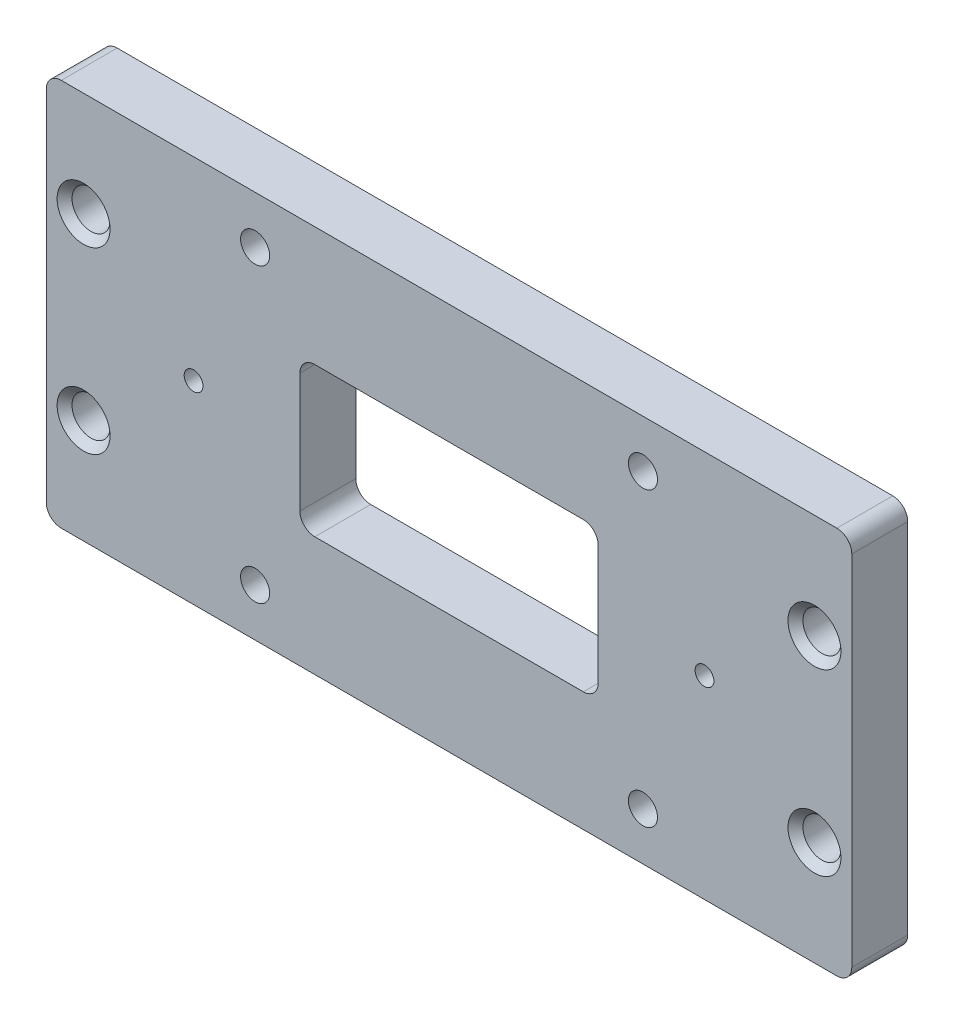
ISO-10303-21;
HEADER;
FILE_DESCRIPTION(('STEP AP214'),'2;1');
FILE_NAME('part.step','',(''),(''),'','','');
FILE_SCHEMA(('AUTOMOTIVE_DESIGN { 1 0 10303 214 1 1 1 1 }'));
ENDSEC;
DATA;
#1=APPLICATION_CONTEXT('core data for automotive mechanical design processes');
#2=APPLICATION_PROTOCOL_DEFINITION('international standard','automotive_design',2000,#1);
#3=PRODUCT_CONTEXT('',#1,'mechanical');
#4=PRODUCT('Part','Part','',(#3));
#5=PRODUCT_RELATED_PRODUCT_CATEGORY('part','',(#4));
#6=PRODUCT_DEFINITION_FORMATION('','',#4);
#7=PRODUCT_DEFINITION_CONTEXT('part definition',#1,'design');
#8=PRODUCT_DEFINITION('design','',#6,#7);
#9=PRODUCT_DEFINITION_SHAPE('','',#8);
#10=(LENGTH_UNIT() NAMED_UNIT(*) SI_UNIT(.MILLI.,.METRE.));
#11=(NAMED_UNIT(*) PLANE_ANGLE_UNIT() SI_UNIT($,.RADIAN.));
#12=(NAMED_UNIT(*) SI_UNIT($,.STERADIAN.) SOLID_ANGLE_UNIT());
#13=UNCERTAINTY_MEASURE_WITH_UNIT(LENGTH_MEASURE(1.E-05),#10,'distance_accuracy_value','');
#14=(GEOMETRIC_REPRESENTATION_CONTEXT(3) GLOBAL_UNCERTAINTY_ASSIGNED_CONTEXT((#13)) GLOBAL_UNIT_ASSIGNED_CONTEXT((#10,
#11,#12)) REPRESENTATION_CONTEXT('',''));
#15=CARTESIAN_POINT('',(0.,0.,0.));
#16=DIRECTION('',(0.,0.,1.));
#17=DIRECTION('',(1.,0.,0.));
#18=AXIS2_PLACEMENT_3D('',#15,#16,#17);
#19=CARTESIAN_POINT('',(68.58,-33.02,9.525));
#20=DIRECTION('',(-1.,0.,0.));
#21=DIRECTION('',(0.,0.,1.));
#22=AXIS2_PLACEMENT_3D('',#19,#20,#21);
#23=PLANE('',#22);
#24=DIRECTION('',(0.,1.,0.));
#25=VECTOR('',#24,1.);
#26=CARTESIAN_POINT('',(68.58,-33.02,9.525));
#27=LINE('',#26,#25);
#28=CARTESIAN_POINT('',(68.58,-30.48,9.525));
#29=VERTEX_POINT('',#28);
#30=CARTESIAN_POINT('',(68.58,30.48,9.525));
#31=VERTEX_POINT('',#30);
#32=EDGE_CURVE('E214',#29,#31,#27,.T.);
#33=ORIENTED_EDGE('',*,*,#32,.F.);
#34=DIRECTION('',(0.,0.,-1.));
#35=VECTOR('',#34,1.);
#36=CARTESIAN_POINT('',(68.58,-30.48,9.525));
#37=LINE('',#36,#35);
#38=CARTESIAN_POINT('',(68.58,-30.48,0.));
#39=VERTEX_POINT('',#38);
#40=EDGE_CURVE('E259',#29,#39,#37,.T.);
#41=ORIENTED_EDGE('',*,*,#40,.T.);
#42=DIRECTION('',(0.,1.,0.));
#43=VECTOR('',#42,1.);
#44=CARTESIAN_POINT('',(68.58,-33.02,0.));
#45=LINE('',#44,#43);
#46=CARTESIAN_POINT('',(68.58,30.48,0.));
#47=VERTEX_POINT('',#46);
#48=EDGE_CURVE('E517',#39,#47,#45,.T.);
#49=ORIENTED_EDGE('',*,*,#48,.T.);
#50=DIRECTION('',(0.,0.,-1.));
#51=VECTOR('',#50,1.);
#52=CARTESIAN_POINT('',(68.58,30.48,9.525));
#53=LINE('',#52,#51);
#54=EDGE_CURVE('E256',#47,#31,#53,.F.);
#55=ORIENTED_EDGE('',*,*,#54,.T.);
#56=EDGE_LOOP('',(#33,#41,#49,#55));
#57=FACE_BOUND('',#56,.T.);
#58=ADVANCED_FACE('F40',(#57),#23,.F.);
#59=CARTESIAN_POINT('',(-68.58,33.02,9.525));
#60=DIRECTION('',(0.,-1.,0.));
#61=DIRECTION('',(0.,0.,-1.));
#62=AXIS2_PLACEMENT_3D('',#59,#60,#61);
#63=PLANE('',#62);
#64=DIRECTION('',(-1.,0.,0.));
#65=VECTOR('',#64,1.);
#66=CARTESIAN_POINT('',(-68.58,33.02,0.));
#67=LINE('',#66,#65);
#68=CARTESIAN_POINT('',(66.04,33.02,0.));
#69=VERTEX_POINT('',#68);
#70=CARTESIAN_POINT('',(-66.04,33.02,0.));
#71=VERTEX_POINT('',#70);
#72=EDGE_CURVE('E224',#69,#71,#67,.T.);
#73=ORIENTED_EDGE('',*,*,#72,.T.);
#74=DIRECTION('',(0.,0.,-1.));
#75=VECTOR('',#74,1.);
#76=CARTESIAN_POINT('',(-66.04,33.02,9.525));
#77=LINE('',#76,#75);
#78=CARTESIAN_POINT('',(-66.04,33.02,9.525));
#79=VERTEX_POINT('',#78);
#80=EDGE_CURVE('E254',#71,#79,#77,.F.);
#81=ORIENTED_EDGE('',*,*,#80,.T.);
#82=DIRECTION('',(-1.,0.,0.));
#83=VECTOR('',#82,1.);
#84=CARTESIAN_POINT('',(-68.58,33.02,9.525));
#85=LINE('',#84,#83);
#86=CARTESIAN_POINT('',(66.04,33.02,9.525));
#87=VERTEX_POINT('',#86);
#88=EDGE_CURVE('E221',#87,#79,#85,.T.);
#89=ORIENTED_EDGE('',*,*,#88,.F.);
#90=DIRECTION('',(0.,0.,-1.));
#91=VECTOR('',#90,1.);
#92=CARTESIAN_POINT('',(66.04,33.02,9.525));
#93=LINE('',#92,#91);
#94=EDGE_CURVE('E250',#87,#69,#93,.T.);
#95=ORIENTED_EDGE('',*,*,#94,.T.);
#96=EDGE_LOOP('',(#73,#81,#89,#95));
#97=FACE_BOUND('',#96,.T.);
#98=ADVANCED_FACE('F399',(#97),#63,.F.);
#99=CARTESIAN_POINT('',(-68.58,-33.02,9.525));
#100=DIRECTION('',(1.,0.,0.));
#101=DIRECTION('',(0.,0.,-1.));
#102=AXIS2_PLACEMENT_3D('',#99,#100,#101);
#103=PLANE('',#102);
#104=DIRECTION('',(0.,-1.,0.));
#105=VECTOR('',#104,1.);
#106=CARTESIAN_POINT('',(-68.58,-33.02,0.));
#107=LINE('',#106,#105);
#108=CARTESIAN_POINT('',(-68.58,30.48,0.));
#109=VERTEX_POINT('',#108);
#110=CARTESIAN_POINT('',(-68.58,-30.48,0.));
#111=VERTEX_POINT('',#110);
#112=EDGE_CURVE('E215',#109,#111,#107,.T.);
#113=ORIENTED_EDGE('',*,*,#112,.T.);
#114=DIRECTION('',(0.,0.,-1.));
#115=VECTOR('',#114,1.);
#116=CARTESIAN_POINT('',(-68.58,-30.48,9.525));
#117=LINE('',#116,#115);
#118=CARTESIAN_POINT('',(-68.58,-30.48,9.525));
#119=VERTEX_POINT('',#118);
#120=EDGE_CURVE('E189',#111,#119,#117,.F.);
#121=ORIENTED_EDGE('',*,*,#120,.T.);
#122=DIRECTION('',(0.,-1.,0.));
#123=VECTOR('',#122,1.);
#124=CARTESIAN_POINT('',(-68.58,-33.02,9.525));
#125=LINE('',#124,#123);
#126=CARTESIAN_POINT('',(-68.58,30.48,9.525));
#127=VERTEX_POINT('',#126);
#128=EDGE_CURVE('E520',#127,#119,#125,.T.);
#129=ORIENTED_EDGE('',*,*,#128,.F.);
#130=DIRECTION('',(0.,0.,-1.));
#131=VECTOR('',#130,1.);
#132=CARTESIAN_POINT('',(-68.58,30.48,9.525));
#133=LINE('',#132,#131);
#134=EDGE_CURVE('E195',#127,#109,#133,.T.);
#135=ORIENTED_EDGE('',*,*,#134,.T.);
#136=EDGE_LOOP('',(#113,#121,#129,#135));
#137=FACE_BOUND('',#136,.T.);
#138=ADVANCED_FACE('F405',(#137),#103,.F.);
#139=CARTESIAN_POINT('',(-68.58,-33.02,9.525));
#140=DIRECTION('',(0.,1.,0.));
#141=DIRECTION('',(0.,0.,1.));
#142=AXIS2_PLACEMENT_3D('',#139,#140,#141);
#143=PLANE('',#142);
#144=DIRECTION('',(1.,0.,0.));
#145=VECTOR('',#144,1.);
#146=CARTESIAN_POINT('',(-68.58,-33.02,9.525));
#147=LINE('',#146,#145);
#148=CARTESIAN_POINT('',(-66.04,-33.02,9.525));
#149=VERTEX_POINT('',#148);
#150=CARTESIAN_POINT('',(66.04,-33.02,9.525));
#151=VERTEX_POINT('',#150);
#152=EDGE_CURVE('E205',#149,#151,#147,.T.);
#153=ORIENTED_EDGE('',*,*,#152,.F.);
#154=DIRECTION('',(0.,0.,-1.));
#155=VECTOR('',#154,1.);
#156=CARTESIAN_POINT('',(-66.04,-33.02,9.525));
#157=LINE('',#156,#155);
#158=CARTESIAN_POINT('',(-66.04,-33.02,0.));
#159=VERTEX_POINT('',#158);
#160=EDGE_CURVE('E188',#149,#159,#157,.T.);
#161=ORIENTED_EDGE('',*,*,#160,.T.);
#162=DIRECTION('',(1.,0.,0.));
#163=VECTOR('',#162,1.);
#164=CARTESIAN_POINT('',(-68.58,-33.02,0.));
#165=LINE('',#164,#163);
#166=CARTESIAN_POINT('',(66.04,-33.02,0.));
#167=VERTEX_POINT('',#166);
#168=EDGE_CURVE('E202',#159,#167,#165,.T.);
#169=ORIENTED_EDGE('',*,*,#168,.T.);
#170=DIRECTION('',(0.,0.,-1.));
#171=VECTOR('',#170,1.);
#172=CARTESIAN_POINT('',(66.04,-33.02,9.525));
#173=LINE('',#172,#171);
#174=EDGE_CURVE('E208',#167,#151,#173,.F.);
#175=ORIENTED_EDGE('',*,*,#174,.T.);
#176=EDGE_LOOP('',(#153,#161,#169,#175));
#177=FACE_BOUND('',#176,.T.);
#178=ADVANCED_FACE('F201',(#177),#143,.F.);
#179=CARTESIAN_POINT('',(0.,0.,9.525));
#180=DIRECTION('',(0.,0.,-1.));
#181=DIRECTION('',(-1.,0.,0.));
#182=AXIS2_PLACEMENT_3D('',#179,#180,#181);
#183=PLANE('',#182);
#184=CARTESIAN_POINT('',(62.23,-15.24,9.525));
#185=DIRECTION('',(0.,0.,-1.));
#186=DIRECTION('',(-1.,0.,0.));
#187=AXIS2_PLACEMENT_3D('',#184,#185,#186);
#188=CIRCLE('',#187,4.50849999999997);
#189=CARTESIAN_POINT('',(57.7215,-15.24,9.525));
#190=VERTEX_POINT('',#189);
#191=EDGE_CURVE('E11',#190,#190,#188,.T.);
#192=ORIENTED_EDGE('',*,*,#191,.T.);
#193=EDGE_LOOP('',(#192));
#194=FACE_BOUND('',#193,.T.);
#195=CARTESIAN_POINT('',(62.23,15.24,9.525));
#196=DIRECTION('',(0.,0.,-1.));
#197=DIRECTION('',(-1.,0.,0.));
#198=AXIS2_PLACEMENT_3D('',#195,#196,#197);
#199=CIRCLE('',#198,4.50849999999997);
#200=CARTESIAN_POINT('',(57.7215,15.24,9.525));
#201=VERTEX_POINT('',#200);
#202=EDGE_CURVE('E49',#201,#201,#199,.T.);
#203=ORIENTED_EDGE('',*,*,#202,.T.);
#204=EDGE_LOOP('',(#203));
#205=FACE_BOUND('',#204,.T.);
#206=CARTESIAN_POINT('',(-62.23,-15.24,9.525));
#207=DIRECTION('',(0.,0.,-1.));
#208=DIRECTION('',(-1.,0.,0.));
#209=AXIS2_PLACEMENT_3D('',#206,#207,#208);
#210=CIRCLE('',#209,4.50850000000001);
#211=CARTESIAN_POINT('',(-66.7385,-15.24,9.525));
#212=VERTEX_POINT('',#211);
#213=EDGE_CURVE('E362',#212,#212,#210,.T.);
#214=ORIENTED_EDGE('',*,*,#213,.T.);
#215=EDGE_LOOP('',(#214));
#216=FACE_BOUND('',#215,.T.);
#217=CARTESIAN_POINT('',(-62.23,15.24,9.525));
#218=DIRECTION('',(0.,0.,-1.));
#219=DIRECTION('',(-1.,0.,0.));
#220=AXIS2_PLACEMENT_3D('',#217,#218,#219);
#221=CIRCLE('',#220,4.5085);
#222=CARTESIAN_POINT('',(-66.7385,15.24,9.525));
#223=VERTEX_POINT('',#222);
#224=EDGE_CURVE('E358',#223,#223,#221,.T.);
#225=ORIENTED_EDGE('',*,*,#224,.T.);
#226=EDGE_LOOP('',(#225));
#227=FACE_BOUND('',#226,.T.);
#228=DIRECTION('',(-1.,0.,0.));
#229=VECTOR('',#228,1.);
#230=CARTESIAN_POINT('',(-25.4,12.7,9.525));
#231=LINE('',#230,#229);
#232=CARTESIAN_POINT('',(22.86,12.7,9.525));
#233=VERTEX_POINT('',#232);
#234=CARTESIAN_POINT('',(-22.86,12.7,9.525));
#235=VERTEX_POINT('',#234);
#236=EDGE_CURVE('E593',#233,#235,#231,.T.);
#237=ORIENTED_EDGE('',*,*,#236,.F.);
#238=CARTESIAN_POINT('',(22.86,10.16,9.525));
#239=DIRECTION('',(0.,0.,-1.));
#240=DIRECTION('',(-1.,0.,0.));
#241=AXIS2_PLACEMENT_3D('',#238,#239,#240);
#242=CIRCLE('',#241,2.54);
#243=CARTESIAN_POINT('',(25.4,10.16,9.525));
#244=VERTEX_POINT('',#243);
#245=EDGE_CURVE('E295',#233,#244,#242,.T.);
#246=ORIENTED_EDGE('',*,*,#245,.T.);
#247=DIRECTION('',(0.,1.,0.));
#248=VECTOR('',#247,1.);
#249=CARTESIAN_POINT('',(25.4,-12.7,9.525));
#250=LINE('',#249,#248);
#251=CARTESIAN_POINT('',(25.4,-10.16,9.525));
#252=VERTEX_POINT('',#251);
#253=EDGE_CURVE('E597',#252,#244,#250,.T.);
#254=ORIENTED_EDGE('',*,*,#253,.F.);
#255=CARTESIAN_POINT('',(22.86,-10.16,9.525));
#256=DIRECTION('',(0.,0.,-1.));
#257=DIRECTION('',(-1.,0.,0.));
#258=AXIS2_PLACEMENT_3D('',#255,#256,#257);
#259=CIRCLE('',#258,2.54);
#260=CARTESIAN_POINT('',(22.86,-12.7,9.525));
#261=VERTEX_POINT('',#260);
#262=EDGE_CURVE('E301',#252,#261,#259,.T.);
#263=ORIENTED_EDGE('',*,*,#262,.T.);
#264=DIRECTION('',(1.,0.,0.));
#265=VECTOR('',#264,1.);
#266=CARTESIAN_POINT('',(-25.4,-12.7,9.525));
#267=LINE('',#266,#265);
#268=CARTESIAN_POINT('',(-22.86,-12.7,9.525));
#269=VERTEX_POINT('',#268);
#270=EDGE_CURVE('E585',#269,#261,#267,.T.);
#271=ORIENTED_EDGE('',*,*,#270,.F.);
#272=CARTESIAN_POINT('',(-22.86,-10.16,9.525));
#273=DIRECTION('',(0.,0.,-1.));
#274=DIRECTION('',(-1.,0.,0.));
#275=AXIS2_PLACEMENT_3D('',#272,#273,#274);
#276=CIRCLE('',#275,2.54);
#277=CARTESIAN_POINT('',(-25.4,-10.16,9.525));
#278=VERTEX_POINT('',#277);
#279=EDGE_CURVE('E289',#269,#278,#276,.T.);
#280=ORIENTED_EDGE('',*,*,#279,.T.);
#281=DIRECTION('',(0.,-1.,0.));
#282=VECTOR('',#281,1.);
#283=CARTESIAN_POINT('',(-25.4,-12.7,9.525));
#284=LINE('',#283,#282);
#285=CARTESIAN_POINT('',(-25.4,10.16,9.525));
#286=VERTEX_POINT('',#285);
#287=EDGE_CURVE('E589',#286,#278,#284,.T.);
#288=ORIENTED_EDGE('',*,*,#287,.F.);
#289=CARTESIAN_POINT('',(-22.86,10.16,9.525));
#290=DIRECTION('',(0.,0.,-1.));
#291=DIRECTION('',(-1.,0.,0.));
#292=AXIS2_PLACEMENT_3D('',#289,#290,#291);
#293=CIRCLE('',#292,2.54);
#294=EDGE_CURVE('E306',#286,#235,#293,.T.);
#295=ORIENTED_EDGE('',*,*,#294,.T.);
#296=EDGE_LOOP('',(#237,#246,#254,#263,#271,#280,#288,#295));
#297=FACE_BOUND('',#296,.T.);
#298=CARTESIAN_POINT('',(43.5,0.,9.525));
#299=DIRECTION('',(0.,0.,1.));
#300=DIRECTION('',(-1.,0.,0.));
#301=AXIS2_PLACEMENT_3D('',#298,#299,#300);
#302=CIRCLE('',#301,1.60000000000001);
#303=CARTESIAN_POINT('',(41.9,0.,9.525));
#304=VERTEX_POINT('',#303);
#305=EDGE_CURVE('E571',#304,#304,#302,.T.);
#306=ORIENTED_EDGE('',*,*,#305,.F.);
#307=EDGE_LOOP('',(#306));
#308=FACE_BOUND('',#307,.T.);
#309=CARTESIAN_POINT('',(-43.5,0.,9.525));
#310=DIRECTION('',(0.,0.,1.));
#311=DIRECTION('',(1.,0.,0.));
#312=AXIS2_PLACEMENT_3D('',#309,#310,#311);
#313=CIRCLE('',#312,1.60000000000001);
#314=CARTESIAN_POINT('',(-41.9,0.,9.525));
#315=VERTEX_POINT('',#314);
#316=EDGE_CURVE('E548',#315,#315,#313,.T.);
#317=ORIENTED_EDGE('',*,*,#316,.F.);
#318=EDGE_LOOP('',(#317));
#319=FACE_BOUND('',#318,.T.);
#320=CARTESIAN_POINT('',(33.02,24.892,9.525));
#321=DIRECTION('',(0.,0.,1.));
#322=DIRECTION('',(-1.,0.,0.));
#323=AXIS2_PLACEMENT_3D('',#320,#321,#322);
#324=CIRCLE('',#323,2.4765);
#325=CARTESIAN_POINT('',(30.5435,24.892,9.525));
#326=VERTEX_POINT('',#325);
#327=EDGE_CURVE('E560',#326,#326,#324,.T.);
#328=ORIENTED_EDGE('',*,*,#327,.F.);
#329=EDGE_LOOP('',(#328));
#330=FACE_BOUND('',#329,.T.);
#331=CARTESIAN_POINT('',(33.02,-24.892,9.525));
#332=DIRECTION('',(0.,0.,1.));
#333=DIRECTION('',(1.,0.,0.));
#334=AXIS2_PLACEMENT_3D('',#331,#332,#333);
#335=CIRCLE('',#334,2.4765);
#336=CARTESIAN_POINT('',(35.4965,-24.892,9.525));
#337=VERTEX_POINT('',#336);
#338=EDGE_CURVE('E552',#337,#337,#335,.T.);
#339=ORIENTED_EDGE('',*,*,#338,.F.);
#340=EDGE_LOOP('',(#339));
#341=FACE_BOUND('',#340,.T.);
#342=CARTESIAN_POINT('',(-33.02,-24.892,9.525));
#343=DIRECTION('',(0.,0.,1.));
#344=DIRECTION('',(-1.,0.,0.));
#345=AXIS2_PLACEMENT_3D('',#342,#343,#344);
#346=CIRCLE('',#345,2.4765);
#347=CARTESIAN_POINT('',(-35.4965,-24.892,9.525));
#348=VERTEX_POINT('',#347);
#349=EDGE_CURVE('E543',#348,#348,#346,.T.);
#350=ORIENTED_EDGE('',*,*,#349,.F.);
#351=EDGE_LOOP('',(#350));
#352=FACE_BOUND('',#351,.T.);
#353=CARTESIAN_POINT('',(-33.02,24.892,9.525));
#354=DIRECTION('',(0.,0.,1.));
#355=DIRECTION('',(1.,0.,0.));
#356=AXIS2_PLACEMENT_3D('',#353,#354,#355);
#357=CIRCLE('',#356,2.4765);
#358=CARTESIAN_POINT('',(-30.5435,24.892,9.525));
#359=VERTEX_POINT('',#358);
#360=EDGE_CURVE('E533',#359,#359,#357,.T.);
#361=ORIENTED_EDGE('',*,*,#360,.F.);
#362=EDGE_LOOP('',(#361));
#363=FACE_BOUND('',#362,.T.);
#364=ORIENTED_EDGE('',*,*,#128,.T.);
#365=CARTESIAN_POINT('',(-66.04,-30.48,9.525));
#366=DIRECTION('',(0.,0.,-1.));
#367=DIRECTION('',(-1.,0.,0.));
#368=AXIS2_PLACEMENT_3D('',#365,#366,#367);
#369=CIRCLE('',#368,2.54);
#370=EDGE_CURVE('E247',#119,#149,#369,.F.);
#371=ORIENTED_EDGE('',*,*,#370,.T.);
#372=ORIENTED_EDGE('',*,*,#152,.T.);
#373=CARTESIAN_POINT('',(66.04,-30.48,9.525));
#374=DIRECTION('',(0.,0.,-1.));
#375=DIRECTION('',(-1.,0.,0.));
#376=AXIS2_PLACEMENT_3D('',#373,#374,#375);
#377=CIRCLE('',#376,2.54);
#378=EDGE_CURVE('E242',#151,#29,#377,.F.);
#379=ORIENTED_EDGE('',*,*,#378,.T.);
#380=ORIENTED_EDGE('',*,*,#32,.T.);
#381=CARTESIAN_POINT('',(66.04,30.48,9.525));
#382=DIRECTION('',(0.,0.,-1.));
#383=DIRECTION('',(-1.,0.,0.));
#384=AXIS2_PLACEMENT_3D('',#381,#382,#383);
#385=CIRCLE('',#384,2.54);
#386=EDGE_CURVE('E239',#31,#87,#385,.F.);
#387=ORIENTED_EDGE('',*,*,#386,.T.);
#388=ORIENTED_EDGE('',*,*,#88,.T.);
#389=CARTESIAN_POINT('',(-66.04,30.48,9.525));
#390=DIRECTION('',(0.,0.,-1.));
#391=DIRECTION('',(-1.,0.,0.));
#392=AXIS2_PLACEMENT_3D('',#389,#390,#391);
#393=CIRCLE('',#392,2.54);
#394=EDGE_CURVE('E245',#79,#127,#393,.F.);
#395=ORIENTED_EDGE('',*,*,#394,.T.);
#396=EDGE_LOOP('',(#364,#371,#372,#379,#380,#387,#388,#395));
#397=FACE_BOUND('',#396,.T.);
#398=ADVANCED_FACE('F371',(#194,#205,#216,#227,#297,#308,#319,#330,#341,#352,#363,#397),#183,.F.);
#399=CARTESIAN_POINT('',(0.,0.,0.));
#400=DIRECTION('',(0.,0.,-1.));
#401=DIRECTION('',(-1.,0.,0.));
#402=AXIS2_PLACEMENT_3D('',#399,#400,#401);
#403=PLANE('',#402);
#404=CARTESIAN_POINT('',(-62.23,-15.24,0.));
#405=DIRECTION('',(0.,0.,-1.));
#406=DIRECTION('',(-1.,0.,0.));
#407=AXIS2_PLACEMENT_3D('',#404,#405,#406);
#408=CIRCLE('',#407,4.50849999999997);
#409=CARTESIAN_POINT('',(-66.7385,-15.24,0.));
#410=VERTEX_POINT('',#409);
#411=EDGE_CURVE('E323',#410,#410,#408,.F.);
#412=ORIENTED_EDGE('',*,*,#411,.T.);
#413=EDGE_LOOP('',(#412));
#414=FACE_BOUND('',#413,.T.);
#415=CARTESIAN_POINT('',(-62.23,15.24,0.));
#416=DIRECTION('',(0.,0.,-1.));
#417=DIRECTION('',(-1.,0.,0.));
#418=AXIS2_PLACEMENT_3D('',#415,#416,#417);
#419=CIRCLE('',#418,4.50849999999998);
#420=CARTESIAN_POINT('',(-66.7385,15.24,0.));
#421=VERTEX_POINT('',#420);
#422=EDGE_CURVE('E320',#421,#421,#419,.F.);
#423=ORIENTED_EDGE('',*,*,#422,.T.);
#424=EDGE_LOOP('',(#423));
#425=FACE_BOUND('',#424,.T.);
#426=CARTESIAN_POINT('',(62.23,-15.24,0.));
#427=DIRECTION('',(0.,0.,-1.));
#428=DIRECTION('',(-1.,0.,0.));
#429=AXIS2_PLACEMENT_3D('',#426,#427,#428);
#430=CIRCLE('',#429,4.50849999999997);
#431=CARTESIAN_POINT('',(57.7215,-15.24,0.));
#432=VERTEX_POINT('',#431);
#433=EDGE_CURVE('E316',#432,#432,#430,.F.);
#434=ORIENTED_EDGE('',*,*,#433,.T.);
#435=EDGE_LOOP('',(#434));
#436=FACE_BOUND('',#435,.T.);
#437=CARTESIAN_POINT('',(62.23,15.24,0.));
#438=DIRECTION('',(0.,0.,-1.));
#439=DIRECTION('',(-1.,0.,0.));
#440=AXIS2_PLACEMENT_3D('',#437,#438,#439);
#441=CIRCLE('',#440,4.5085);
#442=CARTESIAN_POINT('',(57.7215,15.24,0.));
#443=VERTEX_POINT('',#442);
#444=EDGE_CURVE('E312',#443,#443,#441,.F.);
#445=ORIENTED_EDGE('',*,*,#444,.T.);
#446=EDGE_LOOP('',(#445));
#447=FACE_BOUND('',#446,.T.);
#448=DIRECTION('',(1.,0.,0.));
#449=VECTOR('',#448,1.);
#450=CARTESIAN_POINT('',(-25.4,-12.7,0.));
#451=LINE('',#450,#449);
#452=CARTESIAN_POINT('',(-22.86,-12.7,0.));
#453=VERTEX_POINT('',#452);
#454=CARTESIAN_POINT('',(22.86,-12.7,0.));
#455=VERTEX_POINT('',#454);
#456=EDGE_CURVE('E602',#453,#455,#451,.T.);
#457=ORIENTED_EDGE('',*,*,#456,.T.);
#458=CARTESIAN_POINT('',(22.86,-10.16,0.));
#459=DIRECTION('',(0.,0.,-1.));
#460=DIRECTION('',(-1.,0.,0.));
#461=AXIS2_PLACEMENT_3D('',#458,#459,#460);
#462=CIRCLE('',#461,2.54);
#463=CARTESIAN_POINT('',(25.4,-10.16,0.));
#464=VERTEX_POINT('',#463);
#465=EDGE_CURVE('E68',#455,#464,#462,.F.);
#466=ORIENTED_EDGE('',*,*,#465,.T.);
#467=DIRECTION('',(0.,1.,0.));
#468=VECTOR('',#467,1.);
#469=CARTESIAN_POINT('',(25.4,-12.7,0.));
#470=LINE('',#469,#468);
#471=CARTESIAN_POINT('',(25.4,10.16,0.));
#472=VERTEX_POINT('',#471);
#473=EDGE_CURVE('E599',#464,#472,#470,.T.);
#474=ORIENTED_EDGE('',*,*,#473,.T.);
#475=CARTESIAN_POINT('',(22.86,10.16,0.));
#476=DIRECTION('',(0.,0.,-1.));
#477=DIRECTION('',(-1.,0.,0.));
#478=AXIS2_PLACEMENT_3D('',#475,#476,#477);
#479=CIRCLE('',#478,2.54);
#480=CARTESIAN_POINT('',(22.86,12.7,0.));
#481=VERTEX_POINT('',#480);
#482=EDGE_CURVE('E298',#472,#481,#479,.F.);
#483=ORIENTED_EDGE('',*,*,#482,.T.);
#484=DIRECTION('',(-1.,0.,0.));
#485=VECTOR('',#484,1.);
#486=CARTESIAN_POINT('',(-25.4,12.7,0.));
#487=LINE('',#486,#485);
#488=CARTESIAN_POINT('',(-22.86,12.7,0.));
#489=VERTEX_POINT('',#488);
#490=EDGE_CURVE('E579',#481,#489,#487,.T.);
#491=ORIENTED_EDGE('',*,*,#490,.T.);
#492=CARTESIAN_POINT('',(-22.86,10.16,0.));
#493=DIRECTION('',(0.,0.,-1.));
#494=DIRECTION('',(-1.,0.,0.));
#495=AXIS2_PLACEMENT_3D('',#492,#493,#494);
#496=CIRCLE('',#495,2.54);
#497=CARTESIAN_POINT('',(-25.4,10.16,0.));
#498=VERTEX_POINT('',#497);
#499=EDGE_CURVE('E309',#489,#498,#496,.F.);
#500=ORIENTED_EDGE('',*,*,#499,.T.);
#501=DIRECTION('',(0.,-1.,0.));
#502=VECTOR('',#501,1.);
#503=CARTESIAN_POINT('',(-25.4,-12.7,0.));
#504=LINE('',#503,#502);
#505=CARTESIAN_POINT('',(-25.4,-10.16,0.));
#506=VERTEX_POINT('',#505);
#507=EDGE_CURVE('E605',#498,#506,#504,.T.);
#508=ORIENTED_EDGE('',*,*,#507,.T.);
#509=CARTESIAN_POINT('',(-22.86,-10.16,0.));
#510=DIRECTION('',(0.,0.,-1.));
#511=DIRECTION('',(-1.,0.,0.));
#512=AXIS2_PLACEMENT_3D('',#509,#510,#511);
#513=CIRCLE('',#512,2.54);
#514=EDGE_CURVE('E292',#506,#453,#513,.F.);
#515=ORIENTED_EDGE('',*,*,#514,.T.);
#516=EDGE_LOOP('',(#457,#466,#474,#483,#491,#500,#508,#515));
#517=FACE_BOUND('',#516,.T.);
#518=CARTESIAN_POINT('',(43.5,0.,0.));
#519=DIRECTION('',(0.,0.,-1.));
#520=DIRECTION('',(-1.,0.,0.));
#521=AXIS2_PLACEMENT_3D('',#518,#519,#520);
#522=CIRCLE('',#521,1.60000000000001);
#523=CARTESIAN_POINT('',(41.9,0.,0.));
#524=VERTEX_POINT('',#523);
#525=EDGE_CURVE('E575',#524,#524,#522,.F.);
#526=ORIENTED_EDGE('',*,*,#525,.T.);
#527=EDGE_LOOP('',(#526));
#528=FACE_BOUND('',#527,.T.);
#529=CARTESIAN_POINT('',(-43.5,0.,0.));
#530=DIRECTION('',(0.,0.,-1.));
#531=DIRECTION('',(-1.,0.,0.));
#532=AXIS2_PLACEMENT_3D('',#529,#530,#531);
#533=CIRCLE('',#532,1.60000000000001);
#534=CARTESIAN_POINT('',(-45.1,0.,0.));
#535=VERTEX_POINT('',#534);
#536=EDGE_CURVE('E567',#535,#535,#533,.F.);
#537=ORIENTED_EDGE('',*,*,#536,.T.);
#538=EDGE_LOOP('',(#537));
#539=FACE_BOUND('',#538,.T.);
#540=CARTESIAN_POINT('',(33.02,24.892,0.));
#541=DIRECTION('',(0.,0.,1.));
#542=DIRECTION('',(-1.,0.,0.));
#543=AXIS2_PLACEMENT_3D('',#540,#541,#542);
#544=CIRCLE('',#543,2.4765);
#545=CARTESIAN_POINT('',(30.5435,24.892,0.));
#546=VERTEX_POINT('',#545);
#547=EDGE_CURVE('E540',#546,#546,#544,.T.);
#548=ORIENTED_EDGE('',*,*,#547,.T.);
#549=EDGE_LOOP('',(#548));
#550=FACE_BOUND('',#549,.T.);
#551=CARTESIAN_POINT('',(33.02,-24.892,0.));
#552=DIRECTION('',(0.,0.,1.));
#553=DIRECTION('',(1.,0.,0.));
#554=AXIS2_PLACEMENT_3D('',#551,#552,#553);
#555=CIRCLE('',#554,2.4765);
#556=CARTESIAN_POINT('',(35.4965,-24.892,0.));
#557=VERTEX_POINT('',#556);
#558=EDGE_CURVE('E556',#557,#557,#555,.T.);
#559=ORIENTED_EDGE('',*,*,#558,.T.);
#560=EDGE_LOOP('',(#559));
#561=FACE_BOUND('',#560,.T.);
#562=CARTESIAN_POINT('',(-33.02,-24.892,0.));
#563=DIRECTION('',(0.,0.,1.));
#564=DIRECTION('',(-1.,0.,0.));
#565=AXIS2_PLACEMENT_3D('',#562,#563,#564);
#566=CIRCLE('',#565,2.4765);
#567=CARTESIAN_POINT('',(-35.4965,-24.892,0.));
#568=VERTEX_POINT('',#567);
#569=EDGE_CURVE('E547',#568,#568,#566,.T.);
#570=ORIENTED_EDGE('',*,*,#569,.T.);
#571=EDGE_LOOP('',(#570));
#572=FACE_BOUND('',#571,.T.);
#573=CARTESIAN_POINT('',(-33.02,24.892,0.));
#574=DIRECTION('',(0.,0.,1.));
#575=DIRECTION('',(1.,0.,0.));
#576=AXIS2_PLACEMENT_3D('',#573,#574,#575);
#577=CIRCLE('',#576,2.4765);
#578=CARTESIAN_POINT('',(-30.5435,24.892,0.));
#579=VERTEX_POINT('',#578);
#580=EDGE_CURVE('E529',#579,#579,#577,.T.);
#581=ORIENTED_EDGE('',*,*,#580,.T.);
#582=EDGE_LOOP('',(#581));
#583=FACE_BOUND('',#582,.T.);
#584=ORIENTED_EDGE('',*,*,#168,.F.);
#585=CARTESIAN_POINT('',(-66.04,-30.48,0.));
#586=DIRECTION('',(0.,0.,-1.));
#587=DIRECTION('',(-1.,0.,0.));
#588=AXIS2_PLACEMENT_3D('',#585,#586,#587);
#589=CIRCLE('',#588,2.54);
#590=EDGE_CURVE('E184',#159,#111,#589,.T.);
#591=ORIENTED_EDGE('',*,*,#590,.T.);
#592=ORIENTED_EDGE('',*,*,#112,.F.);
#593=CARTESIAN_POINT('',(-66.04,30.48,0.));
#594=DIRECTION('',(0.,0.,-1.));
#595=DIRECTION('',(-1.,0.,0.));
#596=AXIS2_PLACEMENT_3D('',#593,#594,#595);
#597=CIRCLE('',#596,2.54);
#598=EDGE_CURVE('E196',#109,#71,#597,.T.);
#599=ORIENTED_EDGE('',*,*,#598,.T.);
#600=ORIENTED_EDGE('',*,*,#72,.F.);
#601=CARTESIAN_POINT('',(66.04,30.48,0.));
#602=DIRECTION('',(0.,0.,-1.));
#603=DIRECTION('',(-1.,0.,0.));
#604=AXIS2_PLACEMENT_3D('',#601,#602,#603);
#605=CIRCLE('',#604,2.54);
#606=EDGE_CURVE('E207',#69,#47,#605,.T.);
#607=ORIENTED_EDGE('',*,*,#606,.T.);
#608=ORIENTED_EDGE('',*,*,#48,.F.);
#609=CARTESIAN_POINT('',(66.04,-30.48,0.));
#610=DIRECTION('',(0.,0.,-1.));
#611=DIRECTION('',(-1.,0.,0.));
#612=AXIS2_PLACEMENT_3D('',#609,#610,#611);
#613=CIRCLE('',#612,2.54);
#614=EDGE_CURVE('E212',#39,#167,#613,.T.);
#615=ORIENTED_EDGE('',*,*,#614,.T.);
#616=EDGE_LOOP('',(#584,#591,#592,#599,#600,#607,#608,#615));
#617=FACE_BOUND('',#616,.T.);
#618=ADVANCED_FACE('F210',(#414,#425,#436,#447,#517,#528,#539,#550,#561,#572,#583,#617),#403,.T.);
#619=CARTESIAN_POINT('',(-33.02,24.892,0.));
#620=DIRECTION('',(0.,0.,1.));
#621=DIRECTION('',(1.,0.,0.));
#622=AXIS2_PLACEMENT_3D('',#619,#620,#621);
#623=CYLINDRICAL_SURFACE('',#622,2.4765);
#624=ORIENTED_EDGE('',*,*,#580,.F.);
#625=EDGE_LOOP('',(#624));
#626=FACE_BOUND('',#625,.T.);
#627=ORIENTED_EDGE('',*,*,#360,.T.);
#628=EDGE_LOOP('',(#627));
#629=FACE_BOUND('',#628,.T.);
#630=ADVANCED_FACE('F491',(#626,#629),#623,.F.);
#631=CARTESIAN_POINT('',(-33.02,-24.892,0.));
#632=DIRECTION('',(0.,0.,1.));
#633=DIRECTION('',(1.,0.,0.));
#634=AXIS2_PLACEMENT_3D('',#631,#632,#633);
#635=CYLINDRICAL_SURFACE('',#634,2.4765);
#636=ORIENTED_EDGE('',*,*,#569,.F.);
#637=EDGE_LOOP('',(#636));
#638=FACE_BOUND('',#637,.T.);
#639=ORIENTED_EDGE('',*,*,#349,.T.);
#640=EDGE_LOOP('',(#639));
#641=FACE_BOUND('',#640,.T.);
#642=ADVANCED_FACE('F487',(#638,#641),#635,.F.);
#643=CARTESIAN_POINT('',(33.02,-24.892,0.));
#644=DIRECTION('',(0.,0.,1.));
#645=DIRECTION('',(1.,0.,0.));
#646=AXIS2_PLACEMENT_3D('',#643,#644,#645);
#647=CYLINDRICAL_SURFACE('',#646,2.4765);
#648=ORIENTED_EDGE('',*,*,#558,.F.);
#649=EDGE_LOOP('',(#648));
#650=FACE_BOUND('',#649,.T.);
#651=ORIENTED_EDGE('',*,*,#338,.T.);
#652=EDGE_LOOP('',(#651));
#653=FACE_BOUND('',#652,.T.);
#654=ADVANCED_FACE('F483',(#650,#653),#647,.F.);
#655=CARTESIAN_POINT('',(33.02,24.892,0.));
#656=DIRECTION('',(0.,0.,1.));
#657=DIRECTION('',(1.,0.,0.));
#658=AXIS2_PLACEMENT_3D('',#655,#656,#657);
#659=CYLINDRICAL_SURFACE('',#658,2.4765);
#660=ORIENTED_EDGE('',*,*,#547,.F.);
#661=EDGE_LOOP('',(#660));
#662=FACE_BOUND('',#661,.T.);
#663=ORIENTED_EDGE('',*,*,#327,.T.);
#664=EDGE_LOOP('',(#663));
#665=FACE_BOUND('',#664,.T.);
#666=ADVANCED_FACE('F477',(#662,#665),#659,.F.);
#667=CARTESIAN_POINT('',(-62.23,15.24,-0.000999999999999265));
#668=DIRECTION('',(0.,0.,1.));
#669=DIRECTION('',(1.,0.,0.));
#670=AXIS2_PLACEMENT_3D('',#667,#668,#669);
#671=CYLINDRICAL_SURFACE('',#670,3.2385);
#672=CARTESIAN_POINT('',(-62.23,15.24,1.27));
#673=DIRECTION('',(0.,0.,-1.));
#674=DIRECTION('',(-1.,0.,0.));
#675=AXIS2_PLACEMENT_3D('',#672,#673,#674);
#676=CIRCLE('',#675,3.2385);
#677=CARTESIAN_POINT('',(-65.4685,15.24,1.27));
#678=VERTEX_POINT('',#677);
#679=EDGE_CURVE('E339',#678,#678,#676,.T.);
#680=ORIENTED_EDGE('',*,*,#679,.T.);
#681=EDGE_LOOP('',(#680));
#682=FACE_BOUND('',#681,.T.);
#683=CARTESIAN_POINT('',(-62.23,15.24,8.25500000000001));
#684=DIRECTION('',(0.,0.,-1.));
#685=DIRECTION('',(-1.,0.,0.));
#686=AXIS2_PLACEMENT_3D('',#683,#684,#685);
#687=CIRCLE('',#686,3.2385);
#688=CARTESIAN_POINT('',(-65.4685,15.24,8.25500000000001));
#689=VERTEX_POINT('',#688);
#690=EDGE_CURVE('E335',#689,#689,#687,.F.);
#691=ORIENTED_EDGE('',*,*,#690,.T.);
#692=EDGE_LOOP('',(#691));
#693=FACE_BOUND('',#692,.T.);
#694=ADVANCED_FACE('F471',(#682,#693),#671,.F.);
#695=CARTESIAN_POINT('',(-62.23,-15.24,-0.000999999999999265));
#696=DIRECTION('',(0.,0.,1.));
#697=DIRECTION('',(1.,0.,0.));
#698=AXIS2_PLACEMENT_3D('',#695,#696,#697);
#699=CYLINDRICAL_SURFACE('',#698,3.2385);
#700=CARTESIAN_POINT('',(-62.23,-15.24,1.26999999999999));
#701=DIRECTION('',(0.,0.,-1.));
#702=DIRECTION('',(-1.,0.,0.));
#703=AXIS2_PLACEMENT_3D('',#700,#701,#702);
#704=CIRCLE('',#703,3.2385);
#705=CARTESIAN_POINT('',(-65.4685,-15.24,1.26999999999999));
#706=VERTEX_POINT('',#705);
#707=EDGE_CURVE('E331',#706,#706,#704,.T.);
#708=ORIENTED_EDGE('',*,*,#707,.T.);
#709=EDGE_LOOP('',(#708));
#710=FACE_BOUND('',#709,.T.);
#711=CARTESIAN_POINT('',(-62.23,-15.24,8.25499999999998));
#712=DIRECTION('',(0.,0.,-1.));
#713=DIRECTION('',(-1.,0.,0.));
#714=AXIS2_PLACEMENT_3D('',#711,#712,#713);
#715=CIRCLE('',#714,3.2385);
#716=CARTESIAN_POINT('',(-65.4685,-15.24,8.25499999999998));
#717=VERTEX_POINT('',#716);
#718=EDGE_CURVE('E327',#717,#717,#715,.F.);
#719=ORIENTED_EDGE('',*,*,#718,.T.);
#720=EDGE_LOOP('',(#719));
#721=FACE_BOUND('',#720,.T.);
#722=ADVANCED_FACE('F395',(#710,#721),#699,.F.);
#723=CARTESIAN_POINT('',(62.23,-15.24,-0.000999999999999265));
#724=DIRECTION('',(0.,0.,1.));
#725=DIRECTION('',(1.,0.,0.));
#726=AXIS2_PLACEMENT_3D('',#723,#724,#725);
#727=CYLINDRICAL_SURFACE('',#726,3.23849999999999);
#728=CARTESIAN_POINT('',(62.23,-15.24,1.26999999999996));
#729=DIRECTION('',(0.,0.,-1.));
#730=DIRECTION('',(-1.,0.,0.));
#731=AXIS2_PLACEMENT_3D('',#728,#729,#730);
#732=CIRCLE('',#731,3.23849999999999);
#733=CARTESIAN_POINT('',(58.9915,-15.24,1.26999999999996));
#734=VERTEX_POINT('',#733);
#735=EDGE_CURVE('E346',#734,#734,#732,.T.);
#736=ORIENTED_EDGE('',*,*,#735,.T.);
#737=EDGE_LOOP('',(#736));
#738=FACE_BOUND('',#737,.T.);
#739=CARTESIAN_POINT('',(62.23,-15.24,8.25500000000002));
#740=DIRECTION('',(0.,0.,-1.));
#741=DIRECTION('',(-1.,0.,0.));
#742=AXIS2_PLACEMENT_3D('',#739,#740,#741);
#743=CIRCLE('',#742,3.23849999999999);
#744=CARTESIAN_POINT('',(58.9915,-15.24,8.25500000000002));
#745=VERTEX_POINT('',#744);
#746=EDGE_CURVE('E342',#745,#745,#743,.F.);
#747=ORIENTED_EDGE('',*,*,#746,.T.);
#748=EDGE_LOOP('',(#747));
#749=FACE_BOUND('',#748,.T.);
#750=ADVANCED_FACE('F385',(#738,#749),#727,.F.);
#751=CARTESIAN_POINT('',(62.23,15.24,-0.000999999999999265));
#752=DIRECTION('',(0.,0.,1.));
#753=DIRECTION('',(1.,0.,0.));
#754=AXIS2_PLACEMENT_3D('',#751,#752,#753);
#755=CYLINDRICAL_SURFACE('',#754,3.23850000000001);
#756=CARTESIAN_POINT('',(62.23,15.24,1.26999999999998));
#757=DIRECTION('',(0.,0.,-1.));
#758=DIRECTION('',(-1.,0.,0.));
#759=AXIS2_PLACEMENT_3D('',#756,#757,#758);
#760=CIRCLE('',#759,3.23850000000001);
#761=CARTESIAN_POINT('',(58.9915,15.24,1.26999999999998));
#762=VERTEX_POINT('',#761);
#763=EDGE_CURVE('E354',#762,#762,#760,.T.);
#764=ORIENTED_EDGE('',*,*,#763,.T.);
#765=EDGE_LOOP('',(#764));
#766=FACE_BOUND('',#765,.T.);
#767=CARTESIAN_POINT('',(62.23,15.24,8.25500000000003));
#768=DIRECTION('',(0.,0.,-1.));
#769=DIRECTION('',(-1.,0.,0.));
#770=AXIS2_PLACEMENT_3D('',#767,#768,#769);
#771=CIRCLE('',#770,3.23850000000001);
#772=CARTESIAN_POINT('',(58.9915,15.24,8.25500000000003));
#773=VERTEX_POINT('',#772);
#774=EDGE_CURVE('E350',#773,#773,#771,.F.);
#775=ORIENTED_EDGE('',*,*,#774,.T.);
#776=EDGE_LOOP('',(#775));
#777=FACE_BOUND('',#776,.T.);
#778=ADVANCED_FACE('F382',(#766,#777),#755,.F.);
#779=CARTESIAN_POINT('',(-43.5,0.,-0.000999999999999265));
#780=DIRECTION('',(0.,0.,1.));
#781=DIRECTION('',(1.,0.,0.));
#782=AXIS2_PLACEMENT_3D('',#779,#780,#781);
#783=CYLINDRICAL_SURFACE('',#782,1.60000000000001);
#784=ORIENTED_EDGE('',*,*,#536,.F.);
#785=EDGE_LOOP('',(#784));
#786=FACE_BOUND('',#785,.T.);
#787=ORIENTED_EDGE('',*,*,#316,.T.);
#788=EDGE_LOOP('',(#787));
#789=FACE_BOUND('',#788,.T.);
#790=ADVANCED_FACE('F384',(#786,#789),#783,.F.);
#791=CARTESIAN_POINT('',(43.5,0.,-0.000999999999999265));
#792=DIRECTION('',(0.,0.,1.));
#793=DIRECTION('',(1.,0.,0.));
#794=AXIS2_PLACEMENT_3D('',#791,#792,#793);
#795=CYLINDRICAL_SURFACE('',#794,1.60000000000001);
#796=ORIENTED_EDGE('',*,*,#525,.F.);
#797=EDGE_LOOP('',(#796));
#798=FACE_BOUND('',#797,.T.);
#799=ORIENTED_EDGE('',*,*,#305,.T.);
#800=EDGE_LOOP('',(#799));
#801=FACE_BOUND('',#800,.T.);
#802=ADVANCED_FACE('F392',(#798,#801),#795,.F.);
#803=CARTESIAN_POINT('',(25.4,-12.7,-0.000999999999999265));
#804=DIRECTION('',(1.,0.,0.));
#805=DIRECTION('',(0.,0.,-1.));
#806=AXIS2_PLACEMENT_3D('',#803,#804,#805);
#807=PLANE('',#806);
#808=ORIENTED_EDGE('',*,*,#253,.T.);
#809=DIRECTION('',(0.,0.,1.));
#810=VECTOR('',#809,1.);
#811=CARTESIAN_POINT('',(25.4,10.16,0.));
#812=LINE('',#811,#810);
#813=EDGE_CURVE('E59',#244,#472,#812,.F.);
#814=ORIENTED_EDGE('',*,*,#813,.T.);
#815=ORIENTED_EDGE('',*,*,#473,.F.);
#816=DIRECTION('',(0.,0.,1.));
#817=VECTOR('',#816,1.);
#818=CARTESIAN_POINT('',(25.4,-10.16,9.525));
#819=LINE('',#818,#817);
#820=EDGE_CURVE('E283',#464,#252,#819,.T.);
#821=ORIENTED_EDGE('',*,*,#820,.T.);
#822=EDGE_LOOP('',(#808,#814,#815,#821));
#823=FACE_BOUND('',#822,.T.);
#824=ADVANCED_FACE('F626',(#823),#807,.F.);
#825=CARTESIAN_POINT('',(-25.4,-12.7,-0.000999999999999265));
#826=DIRECTION('',(0.,-1.,0.));
#827=DIRECTION('',(0.,0.,-1.));
#828=AXIS2_PLACEMENT_3D('',#825,#826,#827);
#829=PLANE('',#828);
#830=ORIENTED_EDGE('',*,*,#456,.F.);
#831=DIRECTION('',(0.,0.,1.));
#832=VECTOR('',#831,1.);
#833=CARTESIAN_POINT('',(-22.86,-12.7,9.525));
#834=LINE('',#833,#832);
#835=EDGE_CURVE('E266',#453,#269,#834,.T.);
#836=ORIENTED_EDGE('',*,*,#835,.T.);
#837=ORIENTED_EDGE('',*,*,#270,.T.);
#838=DIRECTION('',(0.,0.,1.));
#839=VECTOR('',#838,1.);
#840=CARTESIAN_POINT('',(22.86,-12.7,0.));
#841=LINE('',#840,#839);
#842=EDGE_CURVE('E263',#261,#455,#841,.F.);
#843=ORIENTED_EDGE('',*,*,#842,.T.);
#844=EDGE_LOOP('',(#830,#836,#837,#843));
#845=FACE_BOUND('',#844,.T.);
#846=ADVANCED_FACE('F618',(#845),#829,.F.);
#847=CARTESIAN_POINT('',(-25.4,-12.7,-0.000999999999999265));
#848=DIRECTION('',(-1.,0.,0.));
#849=DIRECTION('',(0.,0.,1.));
#850=AXIS2_PLACEMENT_3D('',#847,#848,#849);
#851=PLANE('',#850);
#852=ORIENTED_EDGE('',*,*,#287,.T.);
#853=DIRECTION('',(0.,0.,1.));
#854=VECTOR('',#853,1.);
#855=CARTESIAN_POINT('',(-25.4,-10.16,0.));
#856=LINE('',#855,#854);
#857=EDGE_CURVE('E274',#278,#506,#856,.F.);
#858=ORIENTED_EDGE('',*,*,#857,.T.);
#859=ORIENTED_EDGE('',*,*,#507,.F.);
#860=DIRECTION('',(0.,0.,1.));
#861=VECTOR('',#860,1.);
#862=CARTESIAN_POINT('',(-25.4,10.16,9.525));
#863=LINE('',#862,#861);
#864=EDGE_CURVE('E270',#498,#286,#863,.T.);
#865=ORIENTED_EDGE('',*,*,#864,.T.);
#866=EDGE_LOOP('',(#852,#858,#859,#865));
#867=FACE_BOUND('',#866,.T.);
#868=ADVANCED_FACE('F632',(#867),#851,.F.);
#869=CARTESIAN_POINT('',(-25.4,12.7,-0.000999999999999265));
#870=DIRECTION('',(0.,1.,0.));
#871=DIRECTION('',(0.,0.,1.));
#872=AXIS2_PLACEMENT_3D('',#869,#870,#871);
#873=PLANE('',#872);
#874=ORIENTED_EDGE('',*,*,#490,.F.);
#875=DIRECTION('',(0.,0.,1.));
#876=VECTOR('',#875,1.);
#877=CARTESIAN_POINT('',(22.86,12.7,9.525));
#878=LINE('',#877,#876);
#879=EDGE_CURVE('E279',#481,#233,#878,.T.);
#880=ORIENTED_EDGE('',*,*,#879,.T.);
#881=ORIENTED_EDGE('',*,*,#236,.T.);
#882=DIRECTION('',(0.,0.,1.));
#883=VECTOR('',#882,1.);
#884=CARTESIAN_POINT('',(-22.86,12.7,0.));
#885=LINE('',#884,#883);
#886=EDGE_CURVE('E277',#235,#489,#885,.F.);
#887=ORIENTED_EDGE('',*,*,#886,.T.);
#888=EDGE_LOOP('',(#874,#880,#881,#887));
#889=FACE_BOUND('',#888,.T.);
#890=ADVANCED_FACE('F414',(#889),#873,.F.);
#891=CARTESIAN_POINT('',(-66.04,-30.48,9.525));
#892=DIRECTION('',(0.,0.,-1.));
#893=DIRECTION('',(-1.,0.,0.));
#894=AXIS2_PLACEMENT_3D('',#891,#892,#893);
#895=CYLINDRICAL_SURFACE('',#894,2.54);
#896=ORIENTED_EDGE('',*,*,#370,.F.);
#897=ORIENTED_EDGE('',*,*,#120,.F.);
#898=ORIENTED_EDGE('',*,*,#590,.F.);
#899=ORIENTED_EDGE('',*,*,#160,.F.);
#900=EDGE_LOOP('',(#896,#897,#898,#899));
#901=FACE_BOUND('',#900,.T.);
#902=ADVANCED_FACE('F187',(#901),#895,.T.);
#903=CARTESIAN_POINT('',(-66.04,30.48,9.525));
#904=DIRECTION('',(0.,0.,-1.));
#905=DIRECTION('',(-1.,0.,0.));
#906=AXIS2_PLACEMENT_3D('',#903,#904,#905);
#907=CYLINDRICAL_SURFACE('',#906,2.54);
#908=ORIENTED_EDGE('',*,*,#394,.F.);
#909=ORIENTED_EDGE('',*,*,#80,.F.);
#910=ORIENTED_EDGE('',*,*,#598,.F.);
#911=ORIENTED_EDGE('',*,*,#134,.F.);
#912=EDGE_LOOP('',(#908,#909,#910,#911));
#913=FACE_BOUND('',#912,.T.);
#914=ADVANCED_FACE('F413',(#913),#907,.T.);
#915=CARTESIAN_POINT('',(66.04,-30.48,9.525));
#916=DIRECTION('',(0.,0.,-1.));
#917=DIRECTION('',(-1.,0.,0.));
#918=AXIS2_PLACEMENT_3D('',#915,#916,#917);
#919=CYLINDRICAL_SURFACE('',#918,2.54);
#920=ORIENTED_EDGE('',*,*,#378,.F.);
#921=ORIENTED_EDGE('',*,*,#174,.F.);
#922=ORIENTED_EDGE('',*,*,#614,.F.);
#923=ORIENTED_EDGE('',*,*,#40,.F.);
#924=EDGE_LOOP('',(#920,#921,#922,#923));
#925=FACE_BOUND('',#924,.T.);
#926=ADVANCED_FACE('F417',(#925),#919,.T.);
#927=CARTESIAN_POINT('',(66.04,30.48,9.525));
#928=DIRECTION('',(0.,0.,-1.));
#929=DIRECTION('',(-1.,0.,0.));
#930=AXIS2_PLACEMENT_3D('',#927,#928,#929);
#931=CYLINDRICAL_SURFACE('',#930,2.54);
#932=ORIENTED_EDGE('',*,*,#386,.F.);
#933=ORIENTED_EDGE('',*,*,#54,.F.);
#934=ORIENTED_EDGE('',*,*,#606,.F.);
#935=ORIENTED_EDGE('',*,*,#94,.F.);
#936=EDGE_LOOP('',(#932,#933,#934,#935));
#937=FACE_BOUND('',#936,.T.);
#938=ADVANCED_FACE('F421',(#937),#931,.T.);
#939=CARTESIAN_POINT('',(-22.86,-10.16,-0.000999999999999265));
#940=DIRECTION('',(0.,0.,-1.));
#941=DIRECTION('',(-1.,0.,0.));
#942=AXIS2_PLACEMENT_3D('',#939,#940,#941);
#943=CYLINDRICAL_SURFACE('',#942,2.54);
#944=ORIENTED_EDGE('',*,*,#514,.F.);
#945=ORIENTED_EDGE('',*,*,#857,.F.);
#946=ORIENTED_EDGE('',*,*,#279,.F.);
#947=ORIENTED_EDGE('',*,*,#835,.F.);
#948=EDGE_LOOP('',(#944,#945,#946,#947));
#949=FACE_BOUND('',#948,.T.);
#950=ADVANCED_FACE('F425',(#949),#943,.F.);
#951=CARTESIAN_POINT('',(22.86,10.16,-0.000999999999999265));
#952=DIRECTION('',(0.,0.,-1.));
#953=DIRECTION('',(-1.,0.,0.));
#954=AXIS2_PLACEMENT_3D('',#951,#952,#953);
#955=CYLINDRICAL_SURFACE('',#954,2.54);
#956=ORIENTED_EDGE('',*,*,#482,.F.);
#957=ORIENTED_EDGE('',*,*,#813,.F.);
#958=ORIENTED_EDGE('',*,*,#245,.F.);
#959=ORIENTED_EDGE('',*,*,#879,.F.);
#960=EDGE_LOOP('',(#956,#957,#958,#959));
#961=FACE_BOUND('',#960,.T.);
#962=ADVANCED_FACE('F429',(#961),#955,.F.);
#963=CARTESIAN_POINT('',(22.86,-10.16,-0.000999999999999265));
#964=DIRECTION('',(0.,0.,-1.));
#965=DIRECTION('',(-1.,0.,0.));
#966=AXIS2_PLACEMENT_3D('',#963,#964,#965);
#967=CYLINDRICAL_SURFACE('',#966,2.54);
#968=ORIENTED_EDGE('',*,*,#465,.F.);
#969=ORIENTED_EDGE('',*,*,#842,.F.);
#970=ORIENTED_EDGE('',*,*,#262,.F.);
#971=ORIENTED_EDGE('',*,*,#820,.F.);
#972=EDGE_LOOP('',(#968,#969,#970,#971));
#973=FACE_BOUND('',#972,.T.);
#974=ADVANCED_FACE('F433',(#973),#967,.F.);
#975=CARTESIAN_POINT('',(-22.86,10.16,-0.000999999999999265));
#976=DIRECTION('',(0.,0.,-1.));
#977=DIRECTION('',(-1.,0.,0.));
#978=AXIS2_PLACEMENT_3D('',#975,#976,#977);
#979=CYLINDRICAL_SURFACE('',#978,2.54);
#980=ORIENTED_EDGE('',*,*,#499,.F.);
#981=ORIENTED_EDGE('',*,*,#886,.F.);
#982=ORIENTED_EDGE('',*,*,#294,.F.);
#983=ORIENTED_EDGE('',*,*,#864,.F.);
#984=EDGE_LOOP('',(#980,#981,#982,#983));
#985=FACE_BOUND('',#984,.T.);
#986=ADVANCED_FACE('F437',(#985),#979,.F.);
#987=CARTESIAN_POINT('',(-62.23,-15.24,0.));
#988=DIRECTION('',(0.,0.,-1.));
#989=DIRECTION('',(-1.,0.,0.));
#990=AXIS2_PLACEMENT_3D('',#987,#988,#989);
#991=CONICAL_SURFACE('',#990,4.50849999999997,0.785398163397442);
#992=ORIENTED_EDGE('',*,*,#707,.F.);
#993=EDGE_LOOP('',(#992));
#994=FACE_BOUND('',#993,.T.);
#995=ORIENTED_EDGE('',*,*,#411,.F.);
#996=EDGE_LOOP('',(#995));
#997=FACE_BOUND('',#996,.T.);
#998=ADVANCED_FACE('F441',(#994,#997),#991,.F.);
#999=CARTESIAN_POINT('',(-62.23,15.24,0.));
#1000=DIRECTION('',(0.,0.,-1.));
#1001=DIRECTION('',(-1.,0.,0.));
#1002=AXIS2_PLACEMENT_3D('',#999,#1000,#1001);
#1003=CONICAL_SURFACE('',#1002,4.50849999999998,0.785398163397442);
#1004=ORIENTED_EDGE('',*,*,#679,.F.);
#1005=EDGE_LOOP('',(#1004));
#1006=FACE_BOUND('',#1005,.T.);
#1007=ORIENTED_EDGE('',*,*,#422,.F.);
#1008=EDGE_LOOP('',(#1007));
#1009=FACE_BOUND('',#1008,.T.);
#1010=ADVANCED_FACE('F445',(#1006,#1009),#1003,.F.);
#1011=CARTESIAN_POINT('',(62.23,-15.24,0.));
#1012=DIRECTION('',(0.,0.,-1.));
#1013=DIRECTION('',(-1.,0.,0.));
#1014=AXIS2_PLACEMENT_3D('',#1011,#1012,#1013);
#1015=CONICAL_SURFACE('',#1014,4.50849999999997,0.785398163397455);
#1016=ORIENTED_EDGE('',*,*,#735,.F.);
#1017=EDGE_LOOP('',(#1016));
#1018=FACE_BOUND('',#1017,.T.);
#1019=ORIENTED_EDGE('',*,*,#433,.F.);
#1020=EDGE_LOOP('',(#1019));
#1021=FACE_BOUND('',#1020,.T.);
#1022=ADVANCED_FACE('F449',(#1018,#1021),#1015,.F.);
#1023=CARTESIAN_POINT('',(62.23,15.24,0.));
#1024=DIRECTION('',(0.,0.,-1.));
#1025=DIRECTION('',(-1.,0.,0.));
#1026=AXIS2_PLACEMENT_3D('',#1023,#1024,#1025);
#1027=CONICAL_SURFACE('',#1026,4.5085,0.785398163397455);
#1028=ORIENTED_EDGE('',*,*,#763,.F.);
#1029=EDGE_LOOP('',(#1028));
#1030=FACE_BOUND('',#1029,.T.);
#1031=ORIENTED_EDGE('',*,*,#444,.F.);
#1032=EDGE_LOOP('',(#1031));
#1033=FACE_BOUND('',#1032,.T.);
#1034=ADVANCED_FACE('F453',(#1030,#1033),#1027,.F.);
#1035=CARTESIAN_POINT('',(62.23,-15.24,8.25500000000002));
#1036=DIRECTION('',(0.,0.,1.));
#1037=DIRECTION('',(1.,0.,0.));
#1038=AXIS2_PLACEMENT_3D('',#1035,#1036,#1037);
#1039=CONICAL_SURFACE('',#1038,3.23849999999999,0.785398163397448);
#1040=ORIENTED_EDGE('',*,*,#191,.F.);
#1041=EDGE_LOOP('',(#1040));
#1042=FACE_BOUND('',#1041,.T.);
#1043=ORIENTED_EDGE('',*,*,#746,.F.);
#1044=EDGE_LOOP('',(#1043));
#1045=FACE_BOUND('',#1044,.T.);
#1046=ADVANCED_FACE('F378',(#1042,#1045),#1039,.F.);
#1047=CARTESIAN_POINT('',(62.23,15.24,8.25500000000003));
#1048=DIRECTION('',(0.,0.,1.));
#1049=DIRECTION('',(1.,0.,0.));
#1050=AXIS2_PLACEMENT_3D('',#1047,#1048,#1049);
#1051=CONICAL_SURFACE('',#1050,3.23850000000001,0.785398163397447);
#1052=ORIENTED_EDGE('',*,*,#202,.F.);
#1053=EDGE_LOOP('',(#1052));
#1054=FACE_BOUND('',#1053,.T.);
#1055=ORIENTED_EDGE('',*,*,#774,.F.);
#1056=EDGE_LOOP('',(#1055));
#1057=FACE_BOUND('',#1056,.T.);
#1058=ADVANCED_FACE('F374',(#1054,#1057),#1051,.F.);
#1059=CARTESIAN_POINT('',(-62.23,-15.24,8.25499999999998));
#1060=DIRECTION('',(0.,0.,1.));
#1061=DIRECTION('',(1.,0.,0.));
#1062=AXIS2_PLACEMENT_3D('',#1059,#1060,#1061);
#1063=CONICAL_SURFACE('',#1062,3.2385,0.785398163397448);
#1064=ORIENTED_EDGE('',*,*,#213,.F.);
#1065=EDGE_LOOP('',(#1064));
#1066=FACE_BOUND('',#1065,.T.);
#1067=ORIENTED_EDGE('',*,*,#718,.F.);
#1068=EDGE_LOOP('',(#1067));
#1069=FACE_BOUND('',#1068,.T.);
#1070=ADVANCED_FACE('F377',(#1066,#1069),#1063,.F.);
#1071=CARTESIAN_POINT('',(-62.23,15.24,8.25500000000001));
#1072=DIRECTION('',(0.,0.,1.));
#1073=DIRECTION('',(1.,0.,0.));
#1074=AXIS2_PLACEMENT_3D('',#1071,#1072,#1073);
#1075=CONICAL_SURFACE('',#1074,3.2385,0.785398163397453);
#1076=ORIENTED_EDGE('',*,*,#224,.F.);
#1077=EDGE_LOOP('',(#1076));
#1078=FACE_BOUND('',#1077,.T.);
#1079=ORIENTED_EDGE('',*,*,#690,.F.);
#1080=EDGE_LOOP('',(#1079));
#1081=FACE_BOUND('',#1080,.T.);
#1082=ADVANCED_FACE('F42',(#1078,#1081),#1075,.F.);
#1083=CLOSED_SHELL('',(#58,#98,#138,#178,#398,#618,#630,#642,#654,#666,#694,#722,#750,#778,#790,
#802,#824,#846,#868,#890,#902,#914,#926,#938,#950,#962,#974,#986,#998,#1010,#1022,#1034,#1046,
#1058,#1070,#1082));
#1084=MANIFOLD_SOLID_BREP('B2',#1083);
#1085=ADVANCED_BREP_SHAPE_REPRESENTATION('',(#18,#1084),#14);
#1086=SHAPE_DEFINITION_REPRESENTATION(#9,#1085);
ENDSEC;
END-ISO-10303-21;
